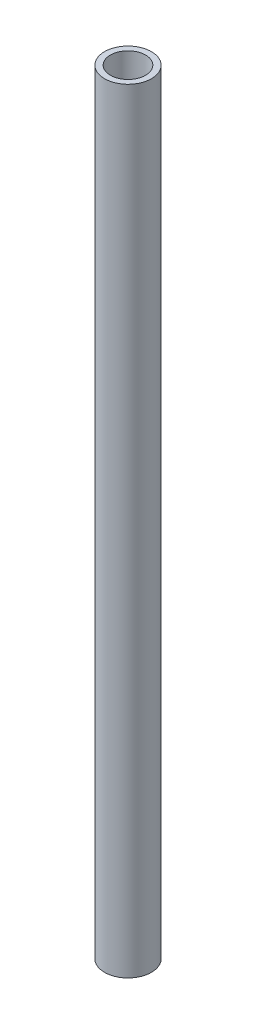
ISO-10303-21;
HEADER;
FILE_DESCRIPTION(('STEP AP214'),'2;1');
FILE_NAME('part.step','',(''),(''),'','','');
FILE_SCHEMA(('AUTOMOTIVE_DESIGN { 1 0 10303 214 1 1 1 1 }'));
ENDSEC;
DATA;
#1=APPLICATION_CONTEXT('core data for automotive mechanical design processes');
#2=APPLICATION_PROTOCOL_DEFINITION('international standard','automotive_design',2000,#1);
#3=PRODUCT_CONTEXT('',#1,'mechanical');
#4=PRODUCT('Part','Part','',(#3));
#5=PRODUCT_RELATED_PRODUCT_CATEGORY('part','',(#4));
#6=PRODUCT_DEFINITION_FORMATION('','',#4);
#7=PRODUCT_DEFINITION_CONTEXT('part definition',#1,'design');
#8=PRODUCT_DEFINITION('design','',#6,#7);
#9=PRODUCT_DEFINITION_SHAPE('','',#8);
#10=(LENGTH_UNIT() NAMED_UNIT(*) SI_UNIT(.MILLI.,.METRE.));
#11=(NAMED_UNIT(*) PLANE_ANGLE_UNIT() SI_UNIT($,.RADIAN.));
#12=(NAMED_UNIT(*) SI_UNIT($,.STERADIAN.) SOLID_ANGLE_UNIT());
#13=UNCERTAINTY_MEASURE_WITH_UNIT(LENGTH_MEASURE(1.E-05),#10,'distance_accuracy_value','');
#14=(GEOMETRIC_REPRESENTATION_CONTEXT(3) GLOBAL_UNCERTAINTY_ASSIGNED_CONTEXT((#13)) GLOBAL_UNIT_ASSIGNED_CONTEXT((#10,
#11,#12)) REPRESENTATION_CONTEXT('',''));
#15=CARTESIAN_POINT('',(0.,0.,0.));
#16=DIRECTION('',(0.,0.,1.));
#17=DIRECTION('',(1.,0.,0.));
#18=AXIS2_PLACEMENT_3D('',#15,#16,#17);
#19=CARTESIAN_POINT('',(-391.18166808322,419.1,-212.743279788072));
#20=DIRECTION('',(0.,1.,0.));
#21=DIRECTION('',(0.,0.,1.));
#22=AXIS2_PLACEMENT_3D('',#19,#20,#21);
#23=PLANE('',#22);
#24=CARTESIAN_POINT('',(-391.18166808322,419.1,-212.743279788072));
#25=DIRECTION('',(0.,1.,0.));
#26=DIRECTION('',(0.,0.,1.));
#27=AXIS2_PLACEMENT_3D('',#24,#25,#26);
#28=CIRCLE('',#27,12.7);
#29=CARTESIAN_POINT('',(-391.18166808322,419.1,-200.043279788072));
#30=VERTEX_POINT('',#29);
#31=EDGE_CURVE('E10',#30,#30,#28,.T.);
#32=ORIENTED_EDGE('',*,*,#31,.T.);
#33=EDGE_LOOP('',(#32));
#34=FACE_BOUND('',#33,.T.);
#35=CARTESIAN_POINT('',(-391.18166808322,419.1,-212.743279788072));
#36=DIRECTION('',(0.,1.,0.));
#37=DIRECTION('',(0.,0.,1.));
#38=AXIS2_PLACEMENT_3D('',#35,#36,#37);
#39=CIRCLE('',#38,9.52500000000002);
#40=CARTESIAN_POINT('',(-391.18166808322,419.1,-203.218279788071));
#41=VERTEX_POINT('',#40);
#42=EDGE_CURVE('E43',#41,#41,#39,.T.);
#43=ORIENTED_EDGE('',*,*,#42,.F.);
#44=EDGE_LOOP('',(#43));
#45=FACE_BOUND('',#44,.T.);
#46=ADVANCED_FACE('F32',(#34,#45),#23,.T.);
#47=CARTESIAN_POINT('',(-391.18166808322,0.,-212.743279788072));
#48=DIRECTION('',(0.,1.,0.));
#49=DIRECTION('',(0.,0.,1.));
#50=AXIS2_PLACEMENT_3D('',#47,#48,#49);
#51=PLANE('',#50);
#52=CARTESIAN_POINT('',(-391.18166808322,0.,-212.743279788072));
#53=DIRECTION('',(0.,1.,0.));
#54=DIRECTION('',(0.,0.,1.));
#55=AXIS2_PLACEMENT_3D('',#52,#53,#54);
#56=CIRCLE('',#55,12.7);
#57=CARTESIAN_POINT('',(-391.18166808322,0.,-200.043279788072));
#58=VERTEX_POINT('',#57);
#59=EDGE_CURVE('E36',#58,#58,#56,.T.);
#60=ORIENTED_EDGE('',*,*,#59,.F.);
#61=EDGE_LOOP('',(#60));
#62=FACE_BOUND('',#61,.T.);
#63=CARTESIAN_POINT('',(-391.18166808322,0.,-212.743279788072));
#64=DIRECTION('',(0.,1.,0.));
#65=DIRECTION('',(0.,0.,1.));
#66=AXIS2_PLACEMENT_3D('',#63,#64,#65);
#67=CIRCLE('',#66,9.52500000000002);
#68=CARTESIAN_POINT('',(-391.18166808322,0.,-203.218279788071));
#69=VERTEX_POINT('',#68);
#70=EDGE_CURVE('E45',#69,#69,#67,.T.);
#71=ORIENTED_EDGE('',*,*,#70,.T.);
#72=EDGE_LOOP('',(#71));
#73=FACE_BOUND('',#72,.T.);
#74=ADVANCED_FACE('F55',(#62,#73),#51,.F.);
#75=CARTESIAN_POINT('',(-391.18166808322,419.1,-212.743279788072));
#76=DIRECTION('',(0.,-1.,0.));
#77=DIRECTION('',(0.,0.,-1.));
#78=AXIS2_PLACEMENT_3D('',#75,#76,#77);
#79=CYLINDRICAL_SURFACE('',#78,12.7);
#80=ORIENTED_EDGE('',*,*,#31,.F.);
#81=EDGE_LOOP('',(#80));
#82=FACE_BOUND('',#81,.T.);
#83=ORIENTED_EDGE('',*,*,#59,.T.);
#84=EDGE_LOOP('',(#83));
#85=FACE_BOUND('',#84,.T.);
#86=ADVANCED_FACE('F34',(#82,#85),#79,.T.);
#87=CARTESIAN_POINT('',(-391.18166808322,419.1,-212.743279788072));
#88=DIRECTION('',(0.,-1.,0.));
#89=DIRECTION('',(0.,0.,-1.));
#90=AXIS2_PLACEMENT_3D('',#87,#88,#89);
#91=CYLINDRICAL_SURFACE('',#90,9.52500000000002);
#92=ORIENTED_EDGE('',*,*,#42,.T.);
#93=EDGE_LOOP('',(#92));
#94=FACE_BOUND('',#93,.T.);
#95=ORIENTED_EDGE('',*,*,#70,.F.);
#96=EDGE_LOOP('',(#95));
#97=FACE_BOUND('',#96,.T.);
#98=ADVANCED_FACE('F51',(#94,#97),#91,.F.);
#99=CLOSED_SHELL('',(#46,#74,#86,#98));
#100=MANIFOLD_SOLID_BREP('B2',#99);
#101=ADVANCED_BREP_SHAPE_REPRESENTATION('',(#18,#100),#14);
#102=SHAPE_DEFINITION_REPRESENTATION(#9,#101);
ENDSEC;
END-ISO-10303-21;
